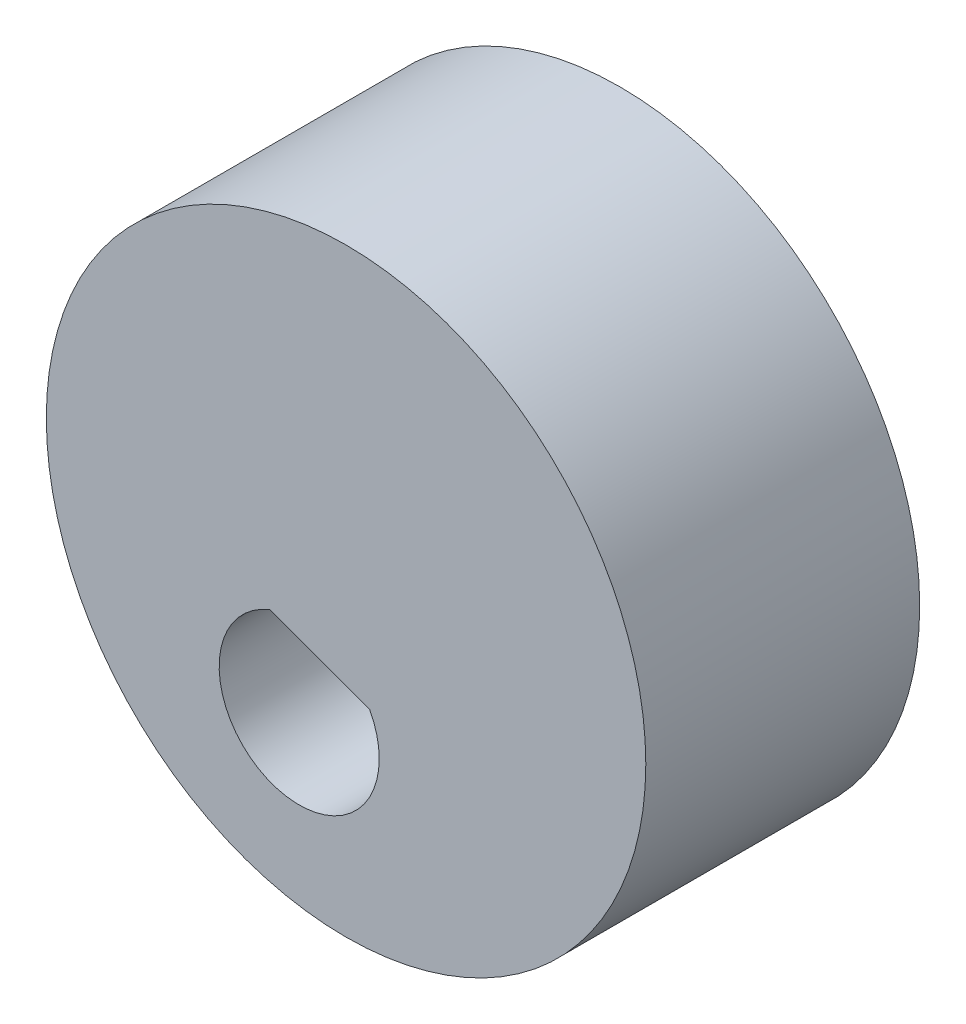
ISO-10303-21;
HEADER;
FILE_DESCRIPTION(('STEP AP214'),'2;1');
FILE_NAME('part.step','',(''),(''),'','','');
FILE_SCHEMA(('AUTOMOTIVE_DESIGN { 1 0 10303 214 1 1 1 1 }'));
ENDSEC;
DATA;
#1=APPLICATION_CONTEXT('core data for automotive mechanical design processes');
#2=APPLICATION_PROTOCOL_DEFINITION('international standard','automotive_design',2000,#1);
#3=PRODUCT_CONTEXT('',#1,'mechanical');
#4=PRODUCT('Part','Part','',(#3));
#5=PRODUCT_RELATED_PRODUCT_CATEGORY('part','',(#4));
#6=PRODUCT_DEFINITION_FORMATION('','',#4);
#7=PRODUCT_DEFINITION_CONTEXT('part definition',#1,'design');
#8=PRODUCT_DEFINITION('design','',#6,#7);
#9=PRODUCT_DEFINITION_SHAPE('','',#8);
#10=(LENGTH_UNIT() NAMED_UNIT(*) SI_UNIT(.MILLI.,.METRE.));
#11=(NAMED_UNIT(*) PLANE_ANGLE_UNIT() SI_UNIT($,.RADIAN.));
#12=(NAMED_UNIT(*) SI_UNIT($,.STERADIAN.) SOLID_ANGLE_UNIT());
#13=UNCERTAINTY_MEASURE_WITH_UNIT(LENGTH_MEASURE(1.E-05),#10,'distance_accuracy_value','');
#14=(GEOMETRIC_REPRESENTATION_CONTEXT(3) GLOBAL_UNCERTAINTY_ASSIGNED_CONTEXT((#13)) GLOBAL_UNIT_ASSIGNED_CONTEXT((#10,
#11,#12)) REPRESENTATION_CONTEXT('',''));
#15=CARTESIAN_POINT('',(0.,0.,0.));
#16=DIRECTION('',(0.,0.,1.));
#17=DIRECTION('',(1.,0.,0.));
#18=AXIS2_PLACEMENT_3D('',#15,#16,#17);
#19=CARTESIAN_POINT('',(-18.6021996740164,-32.8961085016023,-28.9068392376012));
#20=DIRECTION('',(0.,0.,-1.));
#21=DIRECTION('',(-1.,0.,0.));
#22=AXIS2_PLACEMENT_3D('',#19,#20,#21);
#23=CYLINDRICAL_SURFACE('',#22,9.85);
#24=CARTESIAN_POINT('',(-18.6021996740164,-32.8961085016023,-65.7668464163512));
#25=DIRECTION('',(0.,0.,1.));
#26=DIRECTION('',(1.,0.,0.));
#27=AXIS2_PLACEMENT_3D('',#24,#25,#26);
#28=CIRCLE('',#27,9.85);
#29=CARTESIAN_POINT('',(-8.7521996740164,-32.8961085016023,-65.7668464163512));
#30=VERTEX_POINT('',#29);
#31=EDGE_CURVE('E69',#30,#30,#28,.T.);
#32=ORIENTED_EDGE('',*,*,#31,.T.);
#33=EDGE_LOOP('',(#32));
#34=FACE_BOUND('',#33,.T.);
#35=CARTESIAN_POINT('',(-18.6021996740164,-32.8961085016023,-56.7668464163512));
#36=DIRECTION('',(0.,0.,1.));
#37=DIRECTION('',(1.,0.,0.));
#38=AXIS2_PLACEMENT_3D('',#35,#36,#37);
#39=CIRCLE('',#38,9.85);
#40=CARTESIAN_POINT('',(-8.7521996740164,-32.8961085016023,-56.7668464163512));
#41=VERTEX_POINT('',#40);
#42=EDGE_CURVE('E11',#41,#41,#39,.T.);
#43=ORIENTED_EDGE('',*,*,#42,.F.);
#44=EDGE_LOOP('',(#43));
#45=FACE_BOUND('',#44,.T.);
#46=ADVANCED_FACE('F39',(#34,#45),#23,.T.);
#47=CARTESIAN_POINT('',(-18.6021996740164,-32.8961085016023,-65.7668464163512));
#48=DIRECTION('',(0.,0.,1.));
#49=DIRECTION('',(1.,0.,0.));
#50=AXIS2_PLACEMENT_3D('',#47,#48,#49);
#51=PLANE('',#50);
#52=ORIENTED_EDGE('',*,*,#31,.F.);
#53=EDGE_LOOP('',(#52));
#54=FACE_BOUND('',#53,.T.);
#55=CARTESIAN_POINT('',(-20.1421615834172,-37.1244080791623,-65.7668464163512));
#56=DIRECTION('',(0.,0.,1.));
#57=DIRECTION('',(-1.,0.,0.));
#58=AXIS2_PLACEMENT_3D('',#55,#56,#57);
#59=CIRCLE('',#58,2.63000000000005);
#60=CARTESIAN_POINT('',(-21.0951887710412,-34.6731555055483,-65.7668464163512));
#61=VERTEX_POINT('',#60);
#62=CARTESIAN_POINT('',(-17.8256772359992,-35.8790967654066,-65.7668464163512));
#63=VERTEX_POINT('',#62);
#64=EDGE_CURVE('E73',#61,#63,#59,.T.);
#65=ORIENTED_EDGE('',*,*,#64,.T.);
#66=DIRECTION('',(-0.938214184611633,0.346055116698959,0.));
#67=VECTOR('',#66,1.);
#68=CARTESIAN_POINT('',(-21.0951887710412,-34.6731555055483,-65.7668464163512));
#69=LINE('',#68,#67);
#70=EDGE_CURVE('E77',#63,#61,#69,.T.);
#71=ORIENTED_EDGE('',*,*,#70,.T.);
#72=EDGE_LOOP('',(#65,#71));
#73=FACE_BOUND('',#72,.T.);
#74=ADVANCED_FACE('F85',(#54,#73),#51,.F.);
#75=CARTESIAN_POINT('',(-21.0951887710412,-34.6731555055483,-28.9068392376012));
#76=DIRECTION('',(-0.346055116698959,-0.938214184611632,0.));
#77=DIRECTION('',(0.938214184611633,-0.346055116698959,0.));
#78=AXIS2_PLACEMENT_3D('',#75,#76,#77);
#79=PLANE('',#78);
#80=DIRECTION('',(0.,0.,-1.));
#81=VECTOR('',#80,1.);
#82=CARTESIAN_POINT('',(-17.8256772359992,-35.8790967654066,-28.9068392376012));
#83=LINE('',#82,#81);
#84=CARTESIAN_POINT('',(-17.8256772359992,-35.8790967654066,-56.7668464163512));
#85=VERTEX_POINT('',#84);
#86=EDGE_CURVE('E72',#85,#63,#83,.T.);
#87=ORIENTED_EDGE('',*,*,#86,.F.);
#88=DIRECTION('',(-0.938214184611633,0.346055116698959,0.));
#89=VECTOR('',#88,1.);
#90=CARTESIAN_POINT('',(-21.0951887710412,-34.6731555055483,-56.7668464163512));
#91=LINE('',#90,#89);
#92=CARTESIAN_POINT('',(-21.0951887710412,-34.6731555055483,-56.7668464163512));
#93=VERTEX_POINT('',#92);
#94=EDGE_CURVE('E42',#85,#93,#91,.T.);
#95=ORIENTED_EDGE('',*,*,#94,.T.);
#96=DIRECTION('',(0.,0.,-1.));
#97=VECTOR('',#96,1.);
#98=CARTESIAN_POINT('',(-21.0951887710412,-34.6731555055483,-28.9068392376012));
#99=LINE('',#98,#97);
#100=EDGE_CURVE('E60',#93,#61,#99,.T.);
#101=ORIENTED_EDGE('',*,*,#100,.T.);
#102=ORIENTED_EDGE('',*,*,#70,.F.);
#103=EDGE_LOOP('',(#87,#95,#101,#102));
#104=FACE_BOUND('',#103,.T.);
#105=ADVANCED_FACE('F75',(#104),#79,.T.);
#106=CARTESIAN_POINT('',(-20.1421615834172,-37.1244080791623,-28.9068392376012));
#107=DIRECTION('',(0.,0.,-1.));
#108=DIRECTION('',(-1.,0.,0.));
#109=AXIS2_PLACEMENT_3D('',#106,#107,#108);
#110=CYLINDRICAL_SURFACE('',#109,2.63000000000005);
#111=ORIENTED_EDGE('',*,*,#100,.F.);
#112=CARTESIAN_POINT('',(-20.1421615834172,-37.1244080791623,-56.7668464163512));
#113=DIRECTION('',(0.,0.,1.));
#114=DIRECTION('',(1.,0.,0.));
#115=AXIS2_PLACEMENT_3D('',#112,#113,#114);
#116=CIRCLE('',#115,2.63000000000005);
#117=EDGE_CURVE('E53',#93,#85,#116,.T.);
#118=ORIENTED_EDGE('',*,*,#117,.T.);
#119=ORIENTED_EDGE('',*,*,#86,.T.);
#120=ORIENTED_EDGE('',*,*,#64,.F.);
#121=EDGE_LOOP('',(#111,#118,#119,#120));
#122=FACE_BOUND('',#121,.T.);
#123=ADVANCED_FACE('F71',(#122),#110,.F.);
#124=CARTESIAN_POINT('',(-89.9516647288955,-31.1661177037597,-56.7668464163512));
#125=DIRECTION('',(0.,0.,1.));
#126=DIRECTION('',(-0.0392098993163996,-0.999230996214388,0.));
#127=AXIS2_PLACEMENT_3D('',#124,#125,#126);
#128=PLANE('',#127);
#129=ORIENTED_EDGE('',*,*,#117,.F.);
#130=ORIENTED_EDGE('',*,*,#94,.F.);
#131=EDGE_LOOP('',(#129,#130));
#132=FACE_BOUND('',#131,.T.);
#133=ORIENTED_EDGE('',*,*,#42,.T.);
#134=EDGE_LOOP('',(#133));
#135=FACE_BOUND('',#134,.T.);
#136=ADVANCED_FACE('F66',(#132,#135),#128,.T.);
#137=CLOSED_SHELL('',(#46,#74,#105,#123,#136));
#138=MANIFOLD_SOLID_BREP('B2',#137);
#139=ADVANCED_BREP_SHAPE_REPRESENTATION('',(#18,#138),#14);
#140=SHAPE_DEFINITION_REPRESENTATION(#9,#139);
ENDSEC;
END-ISO-10303-21;
